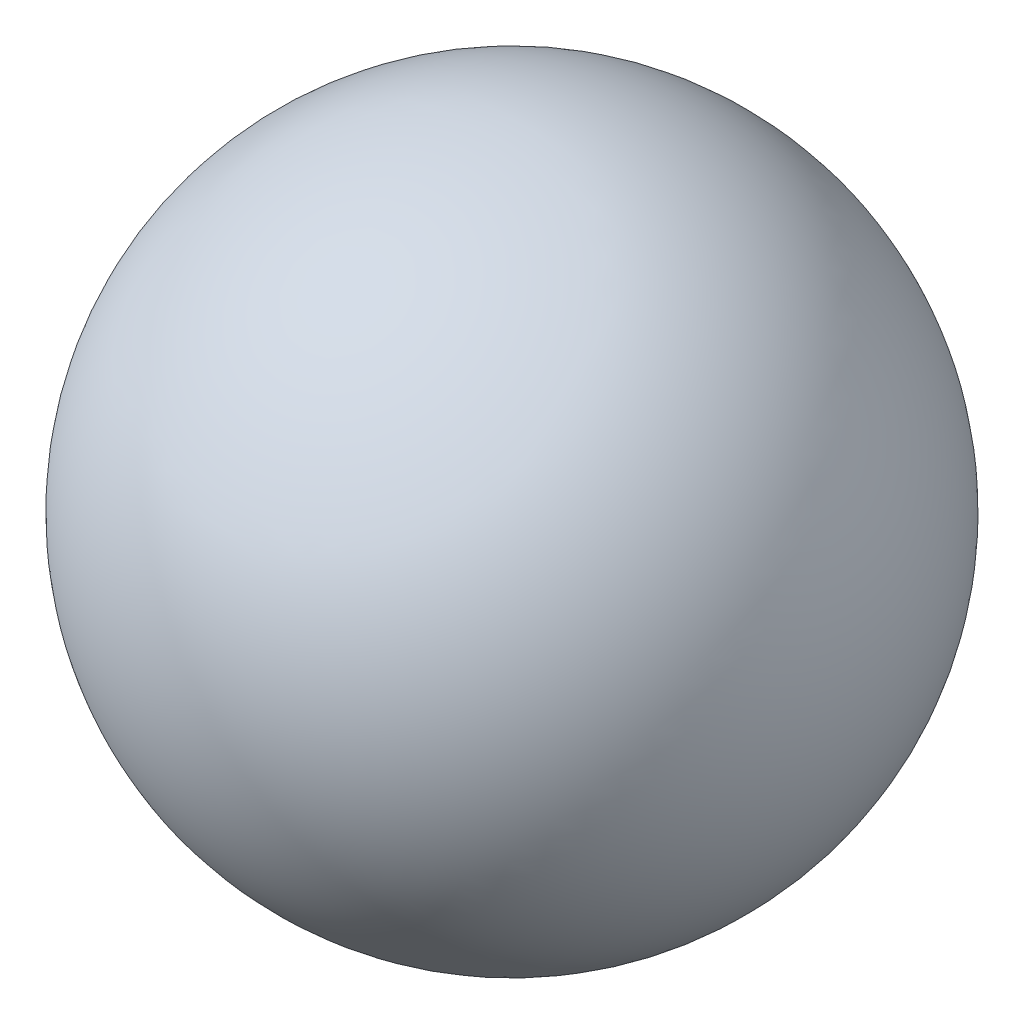
ISO-10303-21;
HEADER;
FILE_DESCRIPTION(('STEP AP214'),'2;1');
FILE_NAME('part.step','',(''),(''),'','','');
FILE_SCHEMA(('AUTOMOTIVE_DESIGN { 1 0 10303 214 1 1 1 1 }'));
ENDSEC;
DATA;
#1=APPLICATION_CONTEXT('core data for automotive mechanical design processes');
#2=APPLICATION_PROTOCOL_DEFINITION('international standard','automotive_design',2000,#1);
#3=PRODUCT_CONTEXT('',#1,'mechanical');
#4=PRODUCT('Part','Part','',(#3));
#5=PRODUCT_RELATED_PRODUCT_CATEGORY('part','',(#4));
#6=PRODUCT_DEFINITION_FORMATION('','',#4);
#7=PRODUCT_DEFINITION_CONTEXT('part definition',#1,'design');
#8=PRODUCT_DEFINITION('design','',#6,#7);
#9=PRODUCT_DEFINITION_SHAPE('','',#8);
#10=(LENGTH_UNIT() NAMED_UNIT(*) SI_UNIT(.MILLI.,.METRE.));
#11=(NAMED_UNIT(*) PLANE_ANGLE_UNIT() SI_UNIT($,.RADIAN.));
#12=(NAMED_UNIT(*) SI_UNIT($,.STERADIAN.) SOLID_ANGLE_UNIT());
#13=UNCERTAINTY_MEASURE_WITH_UNIT(LENGTH_MEASURE(1.E-05),#10,'distance_accuracy_value','');
#14=(GEOMETRIC_REPRESENTATION_CONTEXT(3) GLOBAL_UNCERTAINTY_ASSIGNED_CONTEXT((#13)) GLOBAL_UNIT_ASSIGNED_CONTEXT((#10,
#11,#12)) REPRESENTATION_CONTEXT('',''));
#15=CARTESIAN_POINT('',(0.,0.,0.));
#16=DIRECTION('',(0.,0.,1.));
#17=DIRECTION('',(1.,0.,0.));
#18=AXIS2_PLACEMENT_3D('',#15,#16,#17);
#19=CARTESIAN_POINT('',(0.,0.,0.));
#20=DIRECTION('',(0.,0.,-1.));
#21=DIRECTION('',(1.,0.,0.));
#22=AXIS2_PLACEMENT_3D('',#19,#20,#21);
#23=SPHERICAL_SURFACE('',#22,6.35);
#24=CARTESIAN_POINT('',(0.,0.,-6.35));
#25=VERTEX_POINT('',#24);
#26=VERTEX_LOOP('',#25);
#27=FACE_BOUND('',#26,.T.);
#28=ADVANCED_FACE('F37',(#27),#23,.T.);
#29=CLOSED_SHELL('',(#28));
#30=MANIFOLD_SOLID_BREP('B2',#29);
#31=ADVANCED_BREP_SHAPE_REPRESENTATION('',(#18,#30),#14);
#32=SHAPE_DEFINITION_REPRESENTATION(#9,#31);
ENDSEC;
END-ISO-10303-21;
